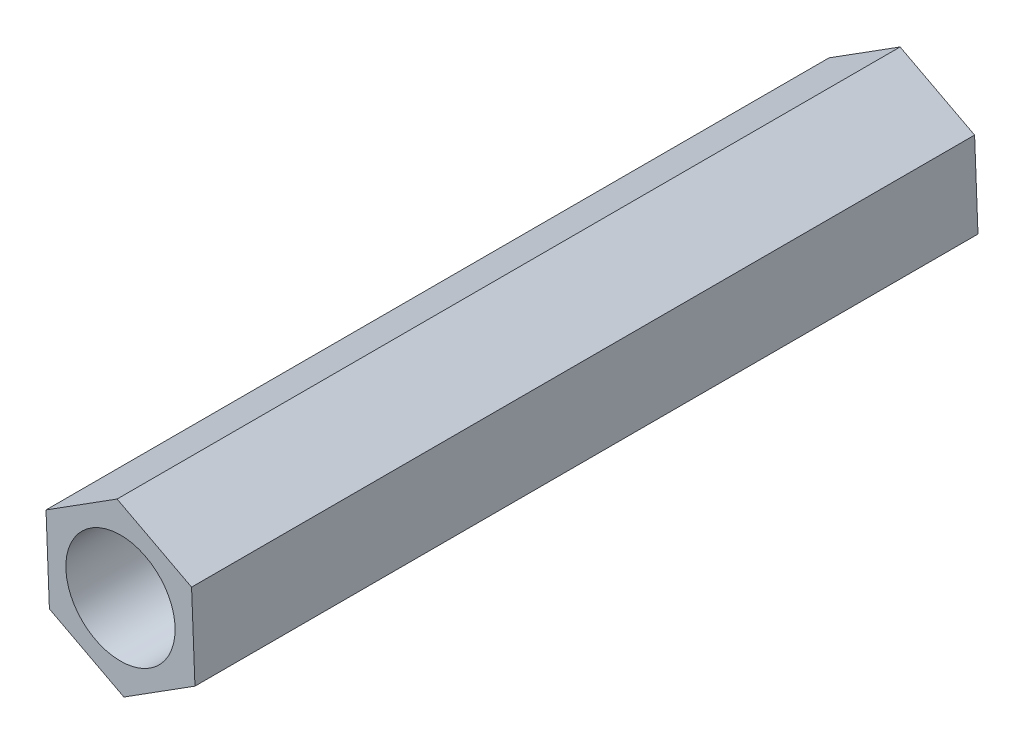
ISO-10303-21;
HEADER;
FILE_DESCRIPTION(('STEP AP214'),'2;1');
FILE_NAME('part.step','',(''),(''),'','','');
FILE_SCHEMA(('AUTOMOTIVE_DESIGN { 1 0 10303 214 1 1 1 1 }'));
ENDSEC;
DATA;
#1=APPLICATION_CONTEXT('core data for automotive mechanical design processes');
#2=APPLICATION_PROTOCOL_DEFINITION('international standard','automotive_design',2000,#1);
#3=PRODUCT_CONTEXT('',#1,'mechanical');
#4=PRODUCT('Part','Part','',(#3));
#5=PRODUCT_RELATED_PRODUCT_CATEGORY('part','',(#4));
#6=PRODUCT_DEFINITION_FORMATION('','',#4);
#7=PRODUCT_DEFINITION_CONTEXT('part definition',#1,'design');
#8=PRODUCT_DEFINITION('design','',#6,#7);
#9=PRODUCT_DEFINITION_SHAPE('','',#8);
#10=(LENGTH_UNIT() NAMED_UNIT(*) SI_UNIT(.MILLI.,.METRE.));
#11=(NAMED_UNIT(*) PLANE_ANGLE_UNIT() SI_UNIT($,.RADIAN.));
#12=(NAMED_UNIT(*) SI_UNIT($,.STERADIAN.) SOLID_ANGLE_UNIT());
#13=UNCERTAINTY_MEASURE_WITH_UNIT(LENGTH_MEASURE(1.E-05),#10,'distance_accuracy_value','');
#14=(GEOMETRIC_REPRESENTATION_CONTEXT(3) GLOBAL_UNCERTAINTY_ASSIGNED_CONTEXT((#13)) GLOBAL_UNIT_ASSIGNED_CONTEXT((#10,
#11,#12)) REPRESENTATION_CONTEXT('',''));
#15=CARTESIAN_POINT('',(0.,0.,0.));
#16=DIRECTION('',(0.,0.,1.));
#17=DIRECTION('',(1.,0.,0.));
#18=AXIS2_PLACEMENT_3D('',#15,#16,#17);
#19=CARTESIAN_POINT('',(0.187134398577114,-4.61500964789918,43.));
#20=DIRECTION('',(-0.53467714895708,0.845056416094883,0.));
#21=DIRECTION('',(-0.845056416094883,-0.53467714895708,0.));
#22=AXIS2_PLACEMENT_3D('',#19,#20,#21);
#23=PLANE('',#22);
#24=DIRECTION('',(0.845056416094883,0.53467714895708,0.));
#25=VECTOR('',#24,1.);
#26=CARTESIAN_POINT('',(0.187134398577114,-4.61500964789918,0.));
#27=LINE('',#26,#25);
#28=CARTESIAN_POINT('',(0.187134398577114,-4.61500964789918,0.));
#29=VERTEX_POINT('',#28);
#30=CARTESIAN_POINT('',(4.09028279307953,-2.14544168085989,0.));
#31=VERTEX_POINT('',#30);
#32=EDGE_CURVE('E118',#29,#31,#27,.T.);
#33=ORIENTED_EDGE('',*,*,#32,.T.);
#34=DIRECTION('',(0.,0.,-1.));
#35=VECTOR('',#34,1.);
#36=CARTESIAN_POINT('',(4.09028279307953,-2.14544168085989,43.));
#37=LINE('',#36,#35);
#38=CARTESIAN_POINT('',(4.09028279307953,-2.14544168085989,43.));
#39=VERTEX_POINT('',#38);
#40=EDGE_CURVE('E11',#39,#31,#37,.T.);
#41=ORIENTED_EDGE('',*,*,#40,.F.);
#42=DIRECTION('',(0.845056416094883,0.53467714895708,0.));
#43=VECTOR('',#42,1.);
#44=CARTESIAN_POINT('',(0.187134398577114,-4.61500964789918,43.));
#45=LINE('',#44,#43);
#46=CARTESIAN_POINT('',(0.187134398577114,-4.61500964789918,43.));
#47=VERTEX_POINT('',#46);
#48=EDGE_CURVE('E129',#47,#39,#45,.T.);
#49=ORIENTED_EDGE('',*,*,#48,.F.);
#50=DIRECTION('',(0.,0.,-1.));
#51=VECTOR('',#50,1.);
#52=CARTESIAN_POINT('',(0.187134398577114,-4.61500964789918,43.));
#53=LINE('',#52,#51);
#54=EDGE_CURVE('E114',#47,#29,#53,.T.);
#55=ORIENTED_EDGE('',*,*,#54,.T.);
#56=EDGE_LOOP('',(#33,#41,#49,#55));
#57=FACE_BOUND('',#56,.T.);
#58=ADVANCED_FACE('F34',(#57),#23,.F.);
#59=CARTESIAN_POINT('',(4.09028279307953,-2.14544168085989,43.));
#60=DIRECTION('',(-0.999178898447742,-0.0405157857724263,0.));
#61=DIRECTION('',(0.0405157857724263,-0.999178898447742,0.));
#62=AXIS2_PLACEMENT_3D('',#59,#60,#61);
#63=PLANE('',#62);
#64=DIRECTION('',(-0.0405157857724263,0.999178898447742,0.));
#65=VECTOR('',#64,1.);
#66=CARTESIAN_POINT('',(4.09028279307953,-2.14544168085989,0.));
#67=LINE('',#66,#65);
#68=CARTESIAN_POINT('',(3.90314839450241,2.4695679670393,0.));
#69=VERTEX_POINT('',#68);
#70=EDGE_CURVE('E121',#31,#69,#67,.T.);
#71=ORIENTED_EDGE('',*,*,#70,.T.);
#72=DIRECTION('',(0.,0.,-1.));
#73=VECTOR('',#72,1.);
#74=CARTESIAN_POINT('',(3.90314839450241,2.4695679670393,43.));
#75=LINE('',#74,#73);
#76=CARTESIAN_POINT('',(3.90314839450241,2.4695679670393,43.));
#77=VERTEX_POINT('',#76);
#78=EDGE_CURVE('E42',#77,#69,#75,.T.);
#79=ORIENTED_EDGE('',*,*,#78,.F.);
#80=DIRECTION('',(-0.0405157857724263,0.999178898447742,0.));
#81=VECTOR('',#80,1.);
#82=CARTESIAN_POINT('',(4.09028279307953,-2.14544168085989,43.));
#83=LINE('',#82,#81);
#84=EDGE_CURVE('E87',#39,#77,#83,.T.);
#85=ORIENTED_EDGE('',*,*,#84,.F.);
#86=ORIENTED_EDGE('',*,*,#40,.T.);
#87=EDGE_LOOP('',(#71,#79,#85,#86));
#88=FACE_BOUND('',#87,.T.);
#89=ADVANCED_FACE('F154',(#88),#63,.F.);
#90=CARTESIAN_POINT('',(3.90314839450241,2.4695679670393,43.));
#91=DIRECTION('',(-0.464501749490663,-0.885572201867309,0.));
#92=DIRECTION('',(0.885572201867309,-0.464501749490663,0.));
#93=AXIS2_PLACEMENT_3D('',#90,#91,#92);
#94=PLANE('',#93);
#95=DIRECTION('',(-0.885572201867309,0.464501749490663,0.));
#96=VECTOR('',#95,1.);
#97=CARTESIAN_POINT('',(3.90314839450241,2.4695679670393,0.));
#98=LINE('',#97,#96);
#99=CARTESIAN_POINT('',(-0.187134398577112,4.61500964789918,0.));
#100=VERTEX_POINT('',#99);
#101=EDGE_CURVE('E124',#69,#100,#98,.T.);
#102=ORIENTED_EDGE('',*,*,#101,.T.);
#103=DIRECTION('',(0.,0.,-1.));
#104=VECTOR('',#103,1.);
#105=CARTESIAN_POINT('',(-0.187134398577112,4.61500964789918,43.));
#106=LINE('',#105,#104);
#107=CARTESIAN_POINT('',(-0.187134398577112,4.61500964789918,43.));
#108=VERTEX_POINT('',#107);
#109=EDGE_CURVE('E109',#108,#100,#106,.T.);
#110=ORIENTED_EDGE('',*,*,#109,.F.);
#111=DIRECTION('',(-0.885572201867309,0.464501749490663,0.));
#112=VECTOR('',#111,1.);
#113=CARTESIAN_POINT('',(3.90314839450241,2.4695679670393,43.));
#114=LINE('',#113,#112);
#115=EDGE_CURVE('E100',#77,#108,#114,.T.);
#116=ORIENTED_EDGE('',*,*,#115,.F.);
#117=ORIENTED_EDGE('',*,*,#78,.T.);
#118=EDGE_LOOP('',(#102,#110,#116,#117));
#119=FACE_BOUND('',#118,.T.);
#120=ADVANCED_FACE('F135',(#119),#94,.F.);
#121=CARTESIAN_POINT('',(-0.187134398577112,4.61500964789918,43.));
#122=DIRECTION('',(0.53467714895708,-0.845056416094883,0.));
#123=DIRECTION('',(0.845056416094883,0.53467714895708,0.));
#124=AXIS2_PLACEMENT_3D('',#121,#122,#123);
#125=PLANE('',#124);
#126=DIRECTION('',(-0.845056416094883,-0.53467714895708,0.));
#127=VECTOR('',#126,1.);
#128=CARTESIAN_POINT('',(-0.187134398577112,4.61500964789918,0.));
#129=LINE('',#128,#127);
#130=CARTESIAN_POINT('',(-4.09028279307953,2.14544168085989,0.));
#131=VERTEX_POINT('',#130);
#132=EDGE_CURVE('E108',#100,#131,#129,.T.);
#133=ORIENTED_EDGE('',*,*,#132,.T.);
#134=DIRECTION('',(0.,0.,-1.));
#135=VECTOR('',#134,1.);
#136=CARTESIAN_POINT('',(-4.09028279307953,2.14544168085989,43.));
#137=LINE('',#136,#135);
#138=CARTESIAN_POINT('',(-4.09028279307953,2.14544168085989,43.));
#139=VERTEX_POINT('',#138);
#140=EDGE_CURVE('E105',#139,#131,#137,.T.);
#141=ORIENTED_EDGE('',*,*,#140,.F.);
#142=DIRECTION('',(-0.845056416094883,-0.53467714895708,0.));
#143=VECTOR('',#142,1.);
#144=CARTESIAN_POINT('',(-0.187134398577112,4.61500964789918,43.));
#145=LINE('',#144,#143);
#146=EDGE_CURVE('E94',#108,#139,#145,.T.);
#147=ORIENTED_EDGE('',*,*,#146,.F.);
#148=ORIENTED_EDGE('',*,*,#109,.T.);
#149=EDGE_LOOP('',(#133,#141,#147,#148));
#150=FACE_BOUND('',#149,.T.);
#151=ADVANCED_FACE('F106',(#150),#125,.F.);
#152=CARTESIAN_POINT('',(-4.09028279307953,2.14544168085989,43.));
#153=DIRECTION('',(0.999178898447742,0.0405157857724258,0.));
#154=DIRECTION('',(-0.0405157857724258,0.999178898447742,0.));
#155=AXIS2_PLACEMENT_3D('',#152,#153,#154);
#156=PLANE('',#155);
#157=DIRECTION('',(0.0405157857724258,-0.999178898447742,0.));
#158=VECTOR('',#157,1.);
#159=CARTESIAN_POINT('',(-4.09028279307953,2.14544168085989,0.));
#160=LINE('',#159,#158);
#161=CARTESIAN_POINT('',(-3.90314839450241,-2.46956796703929,0.));
#162=VERTEX_POINT('',#161);
#163=EDGE_CURVE('E73',#131,#162,#160,.T.);
#164=ORIENTED_EDGE('',*,*,#163,.T.);
#165=DIRECTION('',(0.,0.,-1.));
#166=VECTOR('',#165,1.);
#167=CARTESIAN_POINT('',(-3.90314839450241,-2.46956796703929,43.));
#168=LINE('',#167,#166);
#169=CARTESIAN_POINT('',(-3.90314839450241,-2.46956796703929,43.));
#170=VERTEX_POINT('',#169);
#171=EDGE_CURVE('E110',#170,#162,#168,.T.);
#172=ORIENTED_EDGE('',*,*,#171,.F.);
#173=DIRECTION('',(0.0405157857724258,-0.999178898447742,0.));
#174=VECTOR('',#173,1.);
#175=CARTESIAN_POINT('',(-4.09028279307953,2.14544168085989,43.));
#176=LINE('',#175,#174);
#177=EDGE_CURVE('E98',#139,#170,#176,.T.);
#178=ORIENTED_EDGE('',*,*,#177,.F.);
#179=ORIENTED_EDGE('',*,*,#140,.T.);
#180=EDGE_LOOP('',(#164,#172,#178,#179));
#181=FACE_BOUND('',#180,.T.);
#182=ADVANCED_FACE('F112',(#181),#156,.F.);
#183=CARTESIAN_POINT('',(-3.90314839450241,-2.46956796703929,43.));
#184=DIRECTION('',(0.464501749490662,0.885572201867309,0.));
#185=DIRECTION('',(-0.885572201867309,0.464501749490662,0.));
#186=AXIS2_PLACEMENT_3D('',#183,#184,#185);
#187=PLANE('',#186);
#188=DIRECTION('',(0.885572201867309,-0.464501749490662,0.));
#189=VECTOR('',#188,1.);
#190=CARTESIAN_POINT('',(-3.90314839450241,-2.46956796703929,0.));
#191=LINE('',#190,#189);
#192=EDGE_CURVE('E79',#162,#29,#191,.T.);
#193=ORIENTED_EDGE('',*,*,#192,.T.);
#194=ORIENTED_EDGE('',*,*,#54,.F.);
#195=DIRECTION('',(0.885572201867309,-0.464501749490662,0.));
#196=VECTOR('',#195,1.);
#197=CARTESIAN_POINT('',(-3.90314839450241,-2.46956796703929,43.));
#198=LINE('',#197,#196);
#199=EDGE_CURVE('E50',#170,#47,#198,.T.);
#200=ORIENTED_EDGE('',*,*,#199,.F.);
#201=ORIENTED_EDGE('',*,*,#171,.T.);
#202=EDGE_LOOP('',(#193,#194,#200,#201));
#203=FACE_BOUND('',#202,.T.);
#204=ADVANCED_FACE('F142',(#203),#187,.F.);
#205=CARTESIAN_POINT('',(0.,0.,43.));
#206=DIRECTION('',(0.,0.,1.));
#207=DIRECTION('',(1.,0.,0.));
#208=AXIS2_PLACEMENT_3D('',#205,#206,#207);
#209=PLANE('',#208);
#210=CARTESIAN_POINT('',(0.,0.,43.));
#211=DIRECTION('',(0.,0.,1.));
#212=DIRECTION('',(1.,0.,0.));
#213=AXIS2_PLACEMENT_3D('',#210,#211,#212);
#214=CIRCLE('',#213,3.);
#215=CARTESIAN_POINT('',(3.,0.,43.));
#216=VERTEX_POINT('',#215);
#217=EDGE_CURVE('E207',#216,#216,#214,.T.);
#218=ORIENTED_EDGE('',*,*,#217,.F.);
#219=EDGE_LOOP('',(#218));
#220=FACE_BOUND('',#219,.T.);
#221=ORIENTED_EDGE('',*,*,#48,.T.);
#222=ORIENTED_EDGE('',*,*,#84,.T.);
#223=ORIENTED_EDGE('',*,*,#115,.T.);
#224=ORIENTED_EDGE('',*,*,#146,.T.);
#225=ORIENTED_EDGE('',*,*,#177,.T.);
#226=ORIENTED_EDGE('',*,*,#199,.T.);
#227=EDGE_LOOP('',(#221,#222,#223,#224,#225,#226));
#228=FACE_BOUND('',#227,.T.);
#229=ADVANCED_FACE('F96',(#220,#228),#209,.T.);
#230=CARTESIAN_POINT('',(0.,0.,0.));
#231=DIRECTION('',(0.,0.,1.));
#232=DIRECTION('',(1.,0.,0.));
#233=AXIS2_PLACEMENT_3D('',#230,#231,#232);
#234=PLANE('',#233);
#235=CARTESIAN_POINT('',(0.,0.,0.));
#236=DIRECTION('',(0.,0.,1.));
#237=DIRECTION('',(1.,0.,0.));
#238=AXIS2_PLACEMENT_3D('',#235,#236,#237);
#239=CIRCLE('',#238,3.);
#240=CARTESIAN_POINT('',(3.,0.,0.));
#241=VERTEX_POINT('',#240);
#242=EDGE_CURVE('E122',#241,#241,#239,.F.);
#243=ORIENTED_EDGE('',*,*,#242,.F.);
#244=EDGE_LOOP('',(#243));
#245=FACE_BOUND('',#244,.T.);
#246=ORIENTED_EDGE('',*,*,#32,.F.);
#247=ORIENTED_EDGE('',*,*,#192,.F.);
#248=ORIENTED_EDGE('',*,*,#163,.F.);
#249=ORIENTED_EDGE('',*,*,#132,.F.);
#250=ORIENTED_EDGE('',*,*,#101,.F.);
#251=ORIENTED_EDGE('',*,*,#70,.F.);
#252=EDGE_LOOP('',(#246,#247,#248,#249,#250,#251));
#253=FACE_BOUND('',#252,.T.);
#254=ADVANCED_FACE('F138',(#245,#253),#234,.F.);
#255=CARTESIAN_POINT('',(0.,0.,-0.001000000000001));
#256=DIRECTION('',(0.,0.,1.));
#257=DIRECTION('',(1.,0.,0.));
#258=AXIS2_PLACEMENT_3D('',#255,#256,#257);
#259=CYLINDRICAL_SURFACE('',#258,3.);
#260=ORIENTED_EDGE('',*,*,#217,.T.);
#261=EDGE_LOOP('',(#260));
#262=FACE_BOUND('',#261,.T.);
#263=ORIENTED_EDGE('',*,*,#242,.T.);
#264=EDGE_LOOP('',(#263));
#265=FACE_BOUND('',#264,.T.);
#266=ADVANCED_FACE('F191',(#262,#265),#259,.F.);
#267=CLOSED_SHELL('',(#58,#89,#120,#151,#182,#204,#229,#254,#266));
#268=MANIFOLD_SOLID_BREP('B2',#267);
#269=ADVANCED_BREP_SHAPE_REPRESENTATION('',(#18,#268),#14);
#270=SHAPE_DEFINITION_REPRESENTATION(#9,#269);
ENDSEC;
END-ISO-10303-21;
